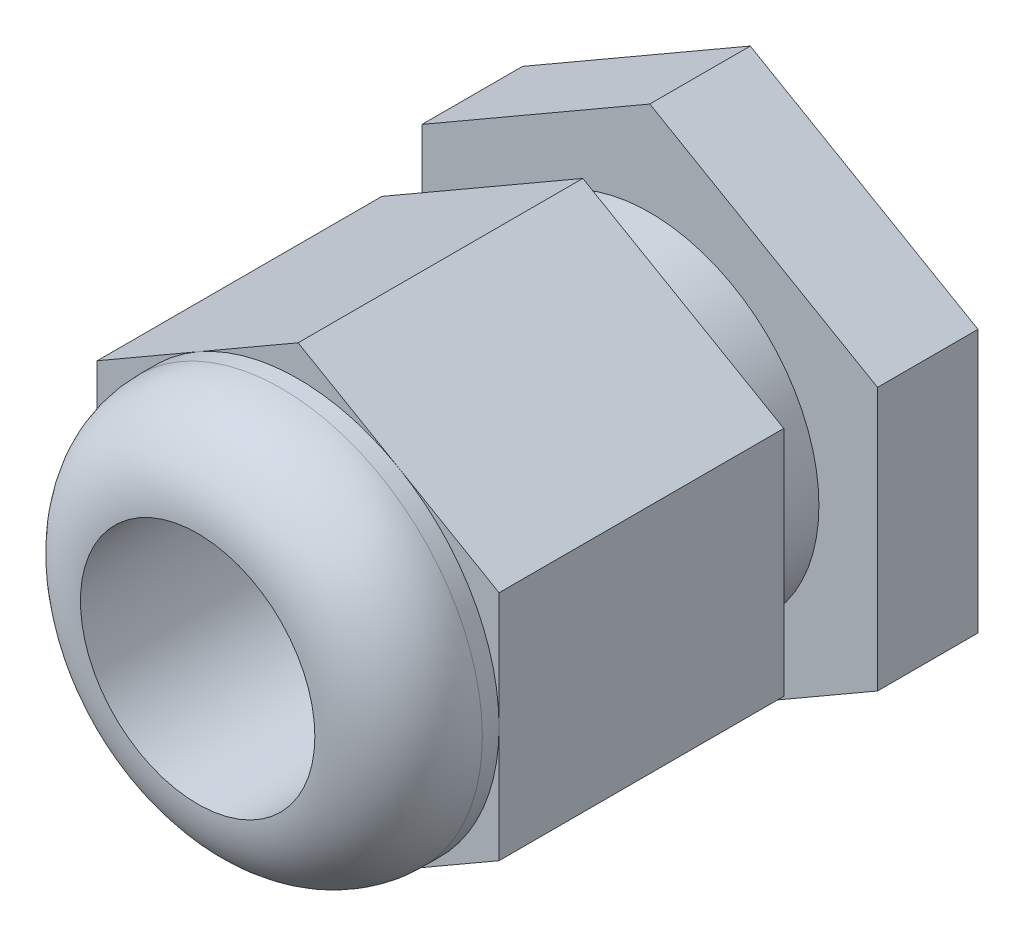
ISO-10303-21;
HEADER;
FILE_DESCRIPTION(('STEP AP214'),'2;1');
FILE_NAME('part.step','',(''),(''),'','','');
FILE_SCHEMA(('AUTOMOTIVE_DESIGN { 1 0 10303 214 1 1 1 1 }'));
ENDSEC;
DATA;
#1=APPLICATION_CONTEXT('core data for automotive mechanical design processes');
#2=APPLICATION_PROTOCOL_DEFINITION('international standard','automotive_design',2000,#1);
#3=PRODUCT_CONTEXT('',#1,'mechanical');
#4=PRODUCT('Part','Part','',(#3));
#5=PRODUCT_RELATED_PRODUCT_CATEGORY('part','',(#4));
#6=PRODUCT_DEFINITION_FORMATION('','',#4);
#7=PRODUCT_DEFINITION_CONTEXT('part definition',#1,'design');
#8=PRODUCT_DEFINITION('design','',#6,#7);
#9=PRODUCT_DEFINITION_SHAPE('','',#8);
#10=(LENGTH_UNIT() NAMED_UNIT(*) SI_UNIT(.MILLI.,.METRE.));
#11=(NAMED_UNIT(*) PLANE_ANGLE_UNIT() SI_UNIT($,.RADIAN.));
#12=(NAMED_UNIT(*) SI_UNIT($,.STERADIAN.) SOLID_ANGLE_UNIT());
#13=UNCERTAINTY_MEASURE_WITH_UNIT(LENGTH_MEASURE(1.E-05),#10,'distance_accuracy_value','');
#14=(GEOMETRIC_REPRESENTATION_CONTEXT(3) GLOBAL_UNCERTAINTY_ASSIGNED_CONTEXT((#13)) GLOBAL_UNIT_ASSIGNED_CONTEXT((#10,
#11,#12)) REPRESENTATION_CONTEXT('',''));
#15=CARTESIAN_POINT('',(0.,0.,0.));
#16=DIRECTION('',(0.,0.,1.));
#17=DIRECTION('',(1.,0.,0.));
#18=AXIS2_PLACEMENT_3D('',#15,#16,#17);
#19=CARTESIAN_POINT('',(0.,0.,-18.5));
#20=DIRECTION('',(0.,0.,-1.));
#21=DIRECTION('',(-1.,0.,0.));
#22=AXIS2_PLACEMENT_3D('',#19,#20,#21);
#23=PLANE('',#22);
#24=DIRECTION('',(0.866025403784439,0.5,0.));
#25=VECTOR('',#24,1.);
#26=CARTESIAN_POINT('',(-13.6,7.85196366097892,-18.5));
#27=LINE('',#26,#25);
#28=CARTESIAN_POINT('',(-13.6,7.85196366097892,-18.5));
#29=VERTEX_POINT('',#28);
#30=CARTESIAN_POINT('',(0.,15.7039273219578,-18.5));
#31=VERTEX_POINT('',#30);
#32=EDGE_CURVE('E185',#29,#31,#27,.T.);
#33=ORIENTED_EDGE('',*,*,#32,.T.);
#34=DIRECTION('',(0.866025403784439,-0.5,0.));
#35=VECTOR('',#34,1.);
#36=CARTESIAN_POINT('',(0.,15.7039273219578,-18.5));
#37=LINE('',#36,#35);
#38=CARTESIAN_POINT('',(13.6,7.85196366097892,-18.5));
#39=VERTEX_POINT('',#38);
#40=EDGE_CURVE('E146',#31,#39,#37,.T.);
#41=ORIENTED_EDGE('',*,*,#40,.T.);
#42=DIRECTION('',(0.,-1.,0.));
#43=VECTOR('',#42,1.);
#44=CARTESIAN_POINT('',(13.6,7.85196366097892,-18.5));
#45=LINE('',#44,#43);
#46=CARTESIAN_POINT('',(13.6,-7.85196366097891,-18.5));
#47=VERTEX_POINT('',#46);
#48=EDGE_CURVE('E189',#39,#47,#45,.T.);
#49=ORIENTED_EDGE('',*,*,#48,.T.);
#50=DIRECTION('',(-0.866025403784439,-0.5,0.));
#51=VECTOR('',#50,1.);
#52=CARTESIAN_POINT('',(13.6,-7.85196366097891,-18.5));
#53=LINE('',#52,#51);
#54=CARTESIAN_POINT('',(0.,-15.7039273219578,-18.5));
#55=VERTEX_POINT('',#54);
#56=EDGE_CURVE('E192',#47,#55,#53,.T.);
#57=ORIENTED_EDGE('',*,*,#56,.T.);
#58=DIRECTION('',(-0.866025403784439,0.5,0.));
#59=VECTOR('',#58,1.);
#60=CARTESIAN_POINT('',(0.,-15.7039273219578,-18.5));
#61=LINE('',#60,#59);
#62=CARTESIAN_POINT('',(-13.6,-7.85196366097891,-18.5));
#63=VERTEX_POINT('',#62);
#64=EDGE_CURVE('E171',#55,#63,#61,.T.);
#65=ORIENTED_EDGE('',*,*,#64,.T.);
#66=DIRECTION('',(0.,1.,0.));
#67=VECTOR('',#66,1.);
#68=CARTESIAN_POINT('',(-13.6,-7.85196366097891,-18.5));
#69=LINE('',#68,#67);
#70=EDGE_CURVE('E168',#63,#29,#69,.T.);
#71=ORIENTED_EDGE('',*,*,#70,.T.);
#72=EDGE_LOOP('',(#33,#41,#49,#57,#65,#71));
#73=FACE_BOUND('',#72,.T.);
#74=CARTESIAN_POINT('',(0.,0.,-18.5));
#75=DIRECTION('',(0.,0.,-1.));
#76=DIRECTION('',(-1.,0.,0.));
#77=AXIS2_PLACEMENT_3D('',#74,#75,#76);
#78=CIRCLE('',#77,10.1);
#79=CARTESIAN_POINT('',(-10.1,0.,-18.5));
#80=VERTEX_POINT('',#79);
#81=EDGE_CURVE('E174',#80,#80,#78,.T.);
#82=ORIENTED_EDGE('',*,*,#81,.F.);
#83=EDGE_LOOP('',(#82));
#84=FACE_BOUND('',#83,.T.);
#85=ADVANCED_FACE('F33',(#73,#84),#23,.T.);
#86=CARTESIAN_POINT('',(0.,0.,-18.5));
#87=DIRECTION('',(0.,0.,1.));
#88=DIRECTION('',(1.,0.,0.));
#89=AXIS2_PLACEMENT_3D('',#86,#87,#88);
#90=CYLINDRICAL_SURFACE('',#89,10.1);
#91=CARTESIAN_POINT('',(0.,0.,-8.5));
#92=DIRECTION('',(0.,0.,1.));
#93=DIRECTION('',(1.,0.,0.));
#94=AXIS2_PLACEMENT_3D('',#91,#92,#93);
#95=CIRCLE('',#94,10.1);
#96=CARTESIAN_POINT('',(10.1,0.,-8.5));
#97=VERTEX_POINT('',#96);
#98=EDGE_CURVE('E41',#97,#97,#95,.F.);
#99=ORIENTED_EDGE('',*,*,#98,.T.);
#100=EDGE_LOOP('',(#99));
#101=FACE_BOUND('',#100,.T.);
#102=CARTESIAN_POINT('',(0.,0.,-12.5));
#103=DIRECTION('',(0.,0.,-1.));
#104=DIRECTION('',(-1.,0.,0.));
#105=AXIS2_PLACEMENT_3D('',#102,#103,#104);
#106=CIRCLE('',#105,10.1);
#107=CARTESIAN_POINT('',(-10.1,0.,-12.5));
#108=VERTEX_POINT('',#107);
#109=EDGE_CURVE('E11',#108,#108,#106,.T.);
#110=ORIENTED_EDGE('',*,*,#109,.F.);
#111=EDGE_LOOP('',(#110));
#112=FACE_BOUND('',#111,.T.);
#113=ADVANCED_FACE('F267',(#101,#112),#90,.T.);
#114=CARTESIAN_POINT('',(0.,0.,-8.5));
#115=DIRECTION('',(0.,0.,1.));
#116=DIRECTION('',(1.,0.,0.));
#117=AXIS2_PLACEMENT_3D('',#114,#115,#116);
#118=PLANE('',#117);
#119=DIRECTION('',(-0.866025403784439,0.5,0.));
#120=VECTOR('',#119,1.);
#121=CARTESIAN_POINT('',(12.,6.92820323027552,-8.5));
#122=LINE('',#121,#120);
#123=CARTESIAN_POINT('',(12.,6.92820323027552,-8.5));
#124=VERTEX_POINT('',#123);
#125=CARTESIAN_POINT('',(0.,13.856406460551,-8.5));
#126=VERTEX_POINT('',#125);
#127=EDGE_CURVE('E208',#124,#126,#122,.T.);
#128=ORIENTED_EDGE('',*,*,#127,.F.);
#129=DIRECTION('',(0.,1.,0.));
#130=VECTOR('',#129,1.);
#131=CARTESIAN_POINT('',(12.,-6.92820323027551,-8.5));
#132=LINE('',#131,#130);
#133=CARTESIAN_POINT('',(12.,-6.92820323027551,-8.5));
#134=VERTEX_POINT('',#133);
#135=EDGE_CURVE('E243',#134,#124,#132,.T.);
#136=ORIENTED_EDGE('',*,*,#135,.F.);
#137=DIRECTION('',(0.866025403784439,0.5,0.));
#138=VECTOR('',#137,1.);
#139=CARTESIAN_POINT('',(0.,-13.856406460551,-8.5));
#140=LINE('',#139,#138);
#141=CARTESIAN_POINT('',(0.,-13.856406460551,-8.5));
#142=VERTEX_POINT('',#141);
#143=EDGE_CURVE('E241',#142,#134,#140,.T.);
#144=ORIENTED_EDGE('',*,*,#143,.F.);
#145=DIRECTION('',(0.866025403784438,-0.5,0.));
#146=VECTOR('',#145,1.);
#147=CARTESIAN_POINT('',(-12.,-6.92820323027551,-8.5));
#148=LINE('',#147,#146);
#149=CARTESIAN_POINT('',(-12.,-6.92820323027551,-8.5));
#150=VERTEX_POINT('',#149);
#151=EDGE_CURVE('E239',#150,#142,#148,.T.);
#152=ORIENTED_EDGE('',*,*,#151,.F.);
#153=DIRECTION('',(0.,-1.,0.));
#154=VECTOR('',#153,1.);
#155=CARTESIAN_POINT('',(-12.,6.92820323027551,-8.5));
#156=LINE('',#155,#154);
#157=CARTESIAN_POINT('',(-12.,6.92820323027551,-8.5));
#158=VERTEX_POINT('',#157);
#159=EDGE_CURVE('E237',#158,#150,#156,.T.);
#160=ORIENTED_EDGE('',*,*,#159,.F.);
#161=DIRECTION('',(-0.866025403784439,-0.5,0.));
#162=VECTOR('',#161,1.);
#163=CARTESIAN_POINT('',(0.,13.856406460551,-8.5));
#164=LINE('',#163,#162);
#165=EDGE_CURVE('E235',#126,#158,#164,.T.);
#166=ORIENTED_EDGE('',*,*,#165,.F.);
#167=EDGE_LOOP('',(#128,#136,#144,#152,#160,#166));
#168=FACE_BOUND('',#167,.T.);
#169=ORIENTED_EDGE('',*,*,#98,.F.);
#170=EDGE_LOOP('',(#169));
#171=FACE_BOUND('',#170,.T.);
#172=ADVANCED_FACE('F270',(#168,#171),#118,.F.);
#173=CARTESIAN_POINT('',(0.,0.,8.5));
#174=DIRECTION('',(0.,0.,1.));
#175=DIRECTION('',(1.,0.,0.));
#176=AXIS2_PLACEMENT_3D('',#173,#174,#175);
#177=PLANE('',#176);
#178=CARTESIAN_POINT('',(0.,0.,8.5));
#179=DIRECTION('',(0.,0.,1.));
#180=DIRECTION('',(1.,0.,0.));
#181=AXIS2_PLACEMENT_3D('',#178,#179,#180);
#182=CIRCLE('',#181,12.);
#183=CARTESIAN_POINT('',(12.,0.,8.5));
#184=VERTEX_POINT('',#183);
#185=CARTESIAN_POINT('',(6.,10.3923048454133,8.5));
#186=VERTEX_POINT('',#185);
#187=EDGE_CURVE('E198',#184,#186,#182,.T.);
#188=ORIENTED_EDGE('',*,*,#187,.F.);
#189=DIRECTION('',(0.,1.,0.));
#190=VECTOR('',#189,1.);
#191=CARTESIAN_POINT('',(12.,-6.92820323027551,8.5));
#192=LINE('',#191,#190);
#193=CARTESIAN_POINT('',(12.,6.92820323027552,8.5));
#194=VERTEX_POINT('',#193);
#195=EDGE_CURVE('E229',#184,#194,#192,.T.);
#196=ORIENTED_EDGE('',*,*,#195,.T.);
#197=DIRECTION('',(-0.866025403784439,0.5,0.));
#198=VECTOR('',#197,1.);
#199=CARTESIAN_POINT('',(12.,6.92820323027552,8.5));
#200=LINE('',#199,#198);
#201=EDGE_CURVE('E210',#194,#186,#200,.T.);
#202=ORIENTED_EDGE('',*,*,#201,.T.);
#203=EDGE_LOOP('',(#188,#196,#202));
#204=FACE_BOUND('',#203,.T.);
#205=ADVANCED_FACE('F272',(#204),#177,.T.);
#206=CARTESIAN_POINT('',(-6.,10.3923048454133,8.5));
#207=VERTEX_POINT('',#206);
#208=EDGE_CURVE('E209',#186,#207,#182,.T.);
#209=ORIENTED_EDGE('',*,*,#208,.F.);
#210=CARTESIAN_POINT('',(0.,13.856406460551,8.5));
#211=VERTEX_POINT('',#210);
#212=EDGE_CURVE('E214',#186,#211,#200,.T.);
#213=ORIENTED_EDGE('',*,*,#212,.T.);
#214=DIRECTION('',(-0.866025403784439,-0.5,0.));
#215=VECTOR('',#214,1.);
#216=CARTESIAN_POINT('',(0.,13.856406460551,8.5));
#217=LINE('',#216,#215);
#218=EDGE_CURVE('E215',#211,#207,#217,.T.);
#219=ORIENTED_EDGE('',*,*,#218,.T.);
#220=EDGE_LOOP('',(#209,#213,#219));
#221=FACE_BOUND('',#220,.T.);
#222=ADVANCED_FACE('F279',(#221),#177,.T.);
#223=CARTESIAN_POINT('',(-12.,0.,8.5));
#224=VERTEX_POINT('',#223);
#225=EDGE_CURVE('E328',#207,#224,#182,.T.);
#226=ORIENTED_EDGE('',*,*,#225,.F.);
#227=CARTESIAN_POINT('',(-12.,6.92820323027551,8.5));
#228=VERTEX_POINT('',#227);
#229=EDGE_CURVE('E213',#207,#228,#217,.T.);
#230=ORIENTED_EDGE('',*,*,#229,.T.);
#231=DIRECTION('',(0.,-1.,0.));
#232=VECTOR('',#231,1.);
#233=CARTESIAN_POINT('',(-12.,6.92820323027551,8.5));
#234=LINE('',#233,#232);
#235=EDGE_CURVE('E219',#228,#224,#234,.T.);
#236=ORIENTED_EDGE('',*,*,#235,.T.);
#237=EDGE_LOOP('',(#226,#230,#236));
#238=FACE_BOUND('',#237,.T.);
#239=ADVANCED_FACE('F315',(#238),#177,.T.);
#240=CARTESIAN_POINT('',(-6.00000000000001,-10.3923048454133,8.5));
#241=VERTEX_POINT('',#240);
#242=EDGE_CURVE('E322',#224,#241,#182,.T.);
#243=ORIENTED_EDGE('',*,*,#242,.F.);
#244=CARTESIAN_POINT('',(-12.,-6.92820323027551,8.5));
#245=VERTEX_POINT('',#244);
#246=EDGE_CURVE('E218',#224,#245,#234,.T.);
#247=ORIENTED_EDGE('',*,*,#246,.T.);
#248=DIRECTION('',(0.866025403784438,-0.5,0.));
#249=VECTOR('',#248,1.);
#250=CARTESIAN_POINT('',(-12.,-6.92820323027551,8.5));
#251=LINE('',#250,#249);
#252=EDGE_CURVE('E223',#245,#241,#251,.T.);
#253=ORIENTED_EDGE('',*,*,#252,.T.);
#254=EDGE_LOOP('',(#243,#247,#253));
#255=FACE_BOUND('',#254,.T.);
#256=ADVANCED_FACE('F308',(#255),#177,.T.);
#257=CARTESIAN_POINT('',(6.,-10.3923048454133,8.5));
#258=VERTEX_POINT('',#257);
#259=EDGE_CURVE('E56',#241,#258,#182,.T.);
#260=ORIENTED_EDGE('',*,*,#259,.F.);
#261=CARTESIAN_POINT('',(0.,-13.856406460551,8.5));
#262=VERTEX_POINT('',#261);
#263=EDGE_CURVE('E222',#241,#262,#251,.T.);
#264=ORIENTED_EDGE('',*,*,#263,.T.);
#265=DIRECTION('',(0.866025403784439,0.5,0.));
#266=VECTOR('',#265,1.);
#267=CARTESIAN_POINT('',(0.,-13.856406460551,8.5));
#268=LINE('',#267,#266);
#269=EDGE_CURVE('E227',#262,#258,#268,.T.);
#270=ORIENTED_EDGE('',*,*,#269,.T.);
#271=EDGE_LOOP('',(#260,#264,#270));
#272=FACE_BOUND('',#271,.T.);
#273=ADVANCED_FACE('F300',(#272),#177,.T.);
#274=CARTESIAN_POINT('',(12.,6.92820323027552,8.5));
#275=DIRECTION('',(-0.5,-0.866025403784439,0.));
#276=DIRECTION('',(0.866025403784439,-0.5,0.));
#277=AXIS2_PLACEMENT_3D('',#274,#275,#276);
#278=PLANE('',#277);
#279=ORIENTED_EDGE('',*,*,#127,.T.);
#280=DIRECTION('',(0.,0.,-1.));
#281=VECTOR('',#280,1.);
#282=CARTESIAN_POINT('',(0.,13.856406460551,8.5));
#283=LINE('',#282,#281);
#284=EDGE_CURVE('E259',#211,#126,#283,.T.);
#285=ORIENTED_EDGE('',*,*,#284,.F.);
#286=ORIENTED_EDGE('',*,*,#212,.F.);
#287=ORIENTED_EDGE('',*,*,#201,.F.);
#288=DIRECTION('',(0.,0.,-1.));
#289=VECTOR('',#288,1.);
#290=CARTESIAN_POINT('',(12.,6.92820323027552,8.5));
#291=LINE('',#290,#289);
#292=EDGE_CURVE('E232',#194,#124,#291,.T.);
#293=ORIENTED_EDGE('',*,*,#292,.T.);
#294=EDGE_LOOP('',(#279,#285,#286,#287,#293));
#295=FACE_BOUND('',#294,.T.);
#296=ADVANCED_FACE('F307',(#295),#278,.F.);
#297=CARTESIAN_POINT('',(0.,13.856406460551,8.5));
#298=DIRECTION('',(0.5,-0.866025403784439,0.));
#299=DIRECTION('',(0.866025403784439,0.5,0.));
#300=AXIS2_PLACEMENT_3D('',#297,#298,#299);
#301=PLANE('',#300);
#302=ORIENTED_EDGE('',*,*,#165,.T.);
#303=DIRECTION('',(0.,0.,-1.));
#304=VECTOR('',#303,1.);
#305=CARTESIAN_POINT('',(-12.,6.92820323027551,8.5));
#306=LINE('',#305,#304);
#307=EDGE_CURVE('E256',#228,#158,#306,.T.);
#308=ORIENTED_EDGE('',*,*,#307,.F.);
#309=ORIENTED_EDGE('',*,*,#229,.F.);
#310=ORIENTED_EDGE('',*,*,#218,.F.);
#311=ORIENTED_EDGE('',*,*,#284,.T.);
#312=EDGE_LOOP('',(#302,#308,#309,#310,#311));
#313=FACE_BOUND('',#312,.T.);
#314=ADVANCED_FACE('F313',(#313),#301,.F.);
#315=CARTESIAN_POINT('',(-12.,6.92820323027551,8.5));
#316=DIRECTION('',(1.,0.,0.));
#317=DIRECTION('',(0.,1.,0.));
#318=AXIS2_PLACEMENT_3D('',#315,#316,#317);
#319=PLANE('',#318);
#320=ORIENTED_EDGE('',*,*,#159,.T.);
#321=DIRECTION('',(0.,0.,-1.));
#322=VECTOR('',#321,1.);
#323=CARTESIAN_POINT('',(-12.,-6.92820323027551,8.5));
#324=LINE('',#323,#322);
#325=EDGE_CURVE('E253',#245,#150,#324,.T.);
#326=ORIENTED_EDGE('',*,*,#325,.F.);
#327=ORIENTED_EDGE('',*,*,#246,.F.);
#328=ORIENTED_EDGE('',*,*,#235,.F.);
#329=ORIENTED_EDGE('',*,*,#307,.T.);
#330=EDGE_LOOP('',(#320,#326,#327,#328,#329));
#331=FACE_BOUND('',#330,.T.);
#332=ADVANCED_FACE('F331',(#331),#319,.F.);
#333=CARTESIAN_POINT('',(-12.,-6.92820323027551,8.5));
#334=DIRECTION('',(0.5,0.866025403784438,0.));
#335=DIRECTION('',(-0.866025403784438,0.5,0.));
#336=AXIS2_PLACEMENT_3D('',#333,#334,#335);
#337=PLANE('',#336);
#338=ORIENTED_EDGE('',*,*,#151,.T.);
#339=DIRECTION('',(0.,0.,-1.));
#340=VECTOR('',#339,1.);
#341=CARTESIAN_POINT('',(0.,-13.856406460551,8.5));
#342=LINE('',#341,#340);
#343=EDGE_CURVE('E250',#262,#142,#342,.T.);
#344=ORIENTED_EDGE('',*,*,#343,.F.);
#345=ORIENTED_EDGE('',*,*,#263,.F.);
#346=ORIENTED_EDGE('',*,*,#252,.F.);
#347=ORIENTED_EDGE('',*,*,#325,.T.);
#348=EDGE_LOOP('',(#338,#344,#345,#346,#347));
#349=FACE_BOUND('',#348,.T.);
#350=ADVANCED_FACE('F350',(#349),#337,.F.);
#351=CARTESIAN_POINT('',(0.,-13.856406460551,8.5));
#352=DIRECTION('',(-0.5,0.866025403784439,0.));
#353=DIRECTION('',(-0.866025403784439,-0.5,0.));
#354=AXIS2_PLACEMENT_3D('',#351,#352,#353);
#355=PLANE('',#354);
#356=ORIENTED_EDGE('',*,*,#143,.T.);
#357=DIRECTION('',(0.,0.,-1.));
#358=VECTOR('',#357,1.);
#359=CARTESIAN_POINT('',(12.,-6.92820323027551,8.5));
#360=LINE('',#359,#358);
#361=CARTESIAN_POINT('',(12.,-6.92820323027551,8.5));
#362=VERTEX_POINT('',#361);
#363=EDGE_CURVE('E247',#362,#134,#360,.T.);
#364=ORIENTED_EDGE('',*,*,#363,.F.);
#365=EDGE_CURVE('E226',#258,#362,#268,.T.);
#366=ORIENTED_EDGE('',*,*,#365,.F.);
#367=ORIENTED_EDGE('',*,*,#269,.F.);
#368=ORIENTED_EDGE('',*,*,#343,.T.);
#369=EDGE_LOOP('',(#356,#364,#366,#367,#368));
#370=FACE_BOUND('',#369,.T.);
#371=ADVANCED_FACE('F304',(#370),#355,.F.);
#372=CARTESIAN_POINT('',(12.,-6.92820323027551,8.5));
#373=DIRECTION('',(-1.,0.,0.));
#374=DIRECTION('',(0.,0.,1.));
#375=AXIS2_PLACEMENT_3D('',#372,#373,#374);
#376=PLANE('',#375);
#377=ORIENTED_EDGE('',*,*,#135,.T.);
#378=ORIENTED_EDGE('',*,*,#292,.F.);
#379=ORIENTED_EDGE('',*,*,#195,.F.);
#380=EDGE_CURVE('E230',#362,#184,#192,.T.);
#381=ORIENTED_EDGE('',*,*,#380,.F.);
#382=ORIENTED_EDGE('',*,*,#363,.T.);
#383=EDGE_LOOP('',(#377,#378,#379,#381,#382));
#384=FACE_BOUND('',#383,.T.);
#385=ADVANCED_FACE('F299',(#384),#376,.F.);
#386=EDGE_CURVE('E48',#258,#184,#182,.T.);
#387=ORIENTED_EDGE('',*,*,#386,.F.);
#388=ORIENTED_EDGE('',*,*,#365,.T.);
#389=ORIENTED_EDGE('',*,*,#380,.T.);
#390=EDGE_LOOP('',(#387,#388,#389));
#391=FACE_BOUND('',#390,.T.);
#392=ADVANCED_FACE('F282',(#391),#177,.T.);
#393=CARTESIAN_POINT('',(0.,0.,14.5));
#394=DIRECTION('',(0.,0.,-1.));
#395=DIRECTION('',(-1.,0.,0.));
#396=AXIS2_PLACEMENT_3D('',#393,#394,#395);
#397=CYLINDRICAL_SURFACE('',#396,12.);
#398=CARTESIAN_POINT('',(0.,0.,9.5));
#399=DIRECTION('',(0.,0.,1.));
#400=DIRECTION('',(1.,0.,0.));
#401=AXIS2_PLACEMENT_3D('',#398,#399,#400);
#402=CIRCLE('',#401,12.);
#403=CARTESIAN_POINT('',(12.,0.,9.5));
#404=VERTEX_POINT('',#403);
#405=EDGE_CURVE('E262',#404,#404,#402,.F.);
#406=ORIENTED_EDGE('',*,*,#405,.T.);
#407=EDGE_LOOP('',(#406));
#408=FACE_BOUND('',#407,.T.);
#409=ORIENTED_EDGE('',*,*,#187,.T.);
#410=ORIENTED_EDGE('',*,*,#208,.T.);
#411=ORIENTED_EDGE('',*,*,#225,.T.);
#412=ORIENTED_EDGE('',*,*,#242,.T.);
#413=ORIENTED_EDGE('',*,*,#259,.T.);
#414=ORIENTED_EDGE('',*,*,#386,.T.);
#415=EDGE_LOOP('',(#409,#410,#411,#412,#413,#414));
#416=FACE_BOUND('',#415,.T.);
#417=ADVANCED_FACE('F295',(#408,#416),#397,.T.);
#418=CARTESIAN_POINT('',(0.,0.,9.5));
#419=DIRECTION('',(0.,0.,1.));
#420=DIRECTION('',(1.,0.,0.));
#421=AXIS2_PLACEMENT_3D('',#418,#419,#420);
#422=TOROIDAL_SURFACE('',#421,7.00000000000001,5.);
#423=ORIENTED_EDGE('',*,*,#405,.F.);
#424=EDGE_LOOP('',(#423));
#425=FACE_BOUND('',#424,.T.);
#426=CARTESIAN_POINT('',(0.,0.,14.5));
#427=DIRECTION('',(0.,0.,1.));
#428=DIRECTION('',(1.,0.,0.));
#429=AXIS2_PLACEMENT_3D('',#426,#427,#428);
#430=CIRCLE('',#429,7.00000000000001);
#431=CARTESIAN_POINT('',(7.00000000000001,0.,14.5));
#432=VERTEX_POINT('',#431);
#433=EDGE_CURVE('E524',#432,#432,#430,.T.);
#434=ORIENTED_EDGE('',*,*,#433,.F.);
#435=EDGE_LOOP('',(#434));
#436=FACE_BOUND('',#435,.T.);
#437=ADVANCED_FACE('F35',(#425,#436),#422,.T.);
#438=CARTESIAN_POINT('',(0.,0.,-12.5));
#439=DIRECTION('',(0.,0.,-1.));
#440=DIRECTION('',(-1.,0.,0.));
#441=AXIS2_PLACEMENT_3D('',#438,#439,#440);
#442=PLANE('',#441);
#443=DIRECTION('',(0.866025403784439,0.5,0.));
#444=VECTOR('',#443,1.);
#445=CARTESIAN_POINT('',(-13.6,7.85196366097892,-12.5));
#446=LINE('',#445,#444);
#447=CARTESIAN_POINT('',(-13.6,7.85196366097892,-12.5));
#448=VERTEX_POINT('',#447);
#449=CARTESIAN_POINT('',(0.,15.7039273219578,-12.5));
#450=VERTEX_POINT('',#449);
#451=EDGE_CURVE('E160',#448,#450,#446,.T.);
#452=ORIENTED_EDGE('',*,*,#451,.F.);
#453=DIRECTION('',(0.,1.,0.));
#454=VECTOR('',#453,1.);
#455=CARTESIAN_POINT('',(-13.6,-7.85196366097891,-12.5));
#456=LINE('',#455,#454);
#457=CARTESIAN_POINT('',(-13.6,-7.85196366097891,-12.5));
#458=VERTEX_POINT('',#457);
#459=EDGE_CURVE('E152',#458,#448,#456,.T.);
#460=ORIENTED_EDGE('',*,*,#459,.F.);
#461=DIRECTION('',(-0.866025403784439,0.5,0.));
#462=VECTOR('',#461,1.);
#463=CARTESIAN_POINT('',(0.,-15.7039273219578,-12.5));
#464=LINE('',#463,#462);
#465=CARTESIAN_POINT('',(0.,-15.7039273219578,-12.5));
#466=VERTEX_POINT('',#465);
#467=EDGE_CURVE('E181',#466,#458,#464,.T.);
#468=ORIENTED_EDGE('',*,*,#467,.F.);
#469=DIRECTION('',(-0.866025403784439,-0.5,0.));
#470=VECTOR('',#469,1.);
#471=CARTESIAN_POINT('',(13.6,-7.85196366097891,-12.5));
#472=LINE('',#471,#470);
#473=CARTESIAN_POINT('',(13.6,-7.85196366097891,-12.5));
#474=VERTEX_POINT('',#473);
#475=EDGE_CURVE('E178',#474,#466,#472,.T.);
#476=ORIENTED_EDGE('',*,*,#475,.F.);
#477=DIRECTION('',(0.,-1.,0.));
#478=VECTOR('',#477,1.);
#479=CARTESIAN_POINT('',(13.6,7.85196366097892,-12.5));
#480=LINE('',#479,#478);
#481=CARTESIAN_POINT('',(13.6,7.85196366097892,-12.5));
#482=VERTEX_POINT('',#481);
#483=EDGE_CURVE('E164',#482,#474,#480,.T.);
#484=ORIENTED_EDGE('',*,*,#483,.F.);
#485=DIRECTION('',(0.866025403784439,-0.5,0.));
#486=VECTOR('',#485,1.);
#487=CARTESIAN_POINT('',(0.,15.7039273219578,-12.5));
#488=LINE('',#487,#486);
#489=EDGE_CURVE('E144',#450,#482,#488,.T.);
#490=ORIENTED_EDGE('',*,*,#489,.F.);
#491=EDGE_LOOP('',(#452,#460,#468,#476,#484,#490));
#492=FACE_BOUND('',#491,.T.);
#493=ORIENTED_EDGE('',*,*,#109,.T.);
#494=EDGE_LOOP('',(#493));
#495=FACE_BOUND('',#494,.T.);
#496=ADVANCED_FACE('F157',(#492,#495),#442,.F.);
#497=CARTESIAN_POINT('',(-13.6,7.85196366097892,-12.5));
#498=DIRECTION('',(-0.5,0.866025403784439,0.));
#499=DIRECTION('',(-0.866025403784439,-0.5,0.));
#500=AXIS2_PLACEMENT_3D('',#497,#498,#499);
#501=PLANE('',#500);
#502=ORIENTED_EDGE('',*,*,#32,.F.);
#503=DIRECTION('',(0.,0.,-1.));
#504=VECTOR('',#503,1.);
#505=CARTESIAN_POINT('',(-13.6,7.85196366097892,-12.5));
#506=LINE('',#505,#504);
#507=EDGE_CURVE('E167',#448,#29,#506,.T.);
#508=ORIENTED_EDGE('',*,*,#507,.F.);
#509=ORIENTED_EDGE('',*,*,#451,.T.);
#510=DIRECTION('',(0.,0.,-1.));
#511=VECTOR('',#510,1.);
#512=CARTESIAN_POINT('',(0.,15.7039273219578,-12.5));
#513=LINE('',#512,#511);
#514=EDGE_CURVE('E141',#450,#31,#513,.T.);
#515=ORIENTED_EDGE('',*,*,#514,.T.);
#516=EDGE_LOOP('',(#502,#508,#509,#515));
#517=FACE_BOUND('',#516,.T.);
#518=ADVANCED_FACE('F166',(#517),#501,.T.);
#519=CARTESIAN_POINT('',(-13.6,-7.85196366097891,-12.5));
#520=DIRECTION('',(-1.,0.,0.));
#521=DIRECTION('',(0.,0.,1.));
#522=AXIS2_PLACEMENT_3D('',#519,#520,#521);
#523=PLANE('',#522);
#524=ORIENTED_EDGE('',*,*,#70,.F.);
#525=DIRECTION('',(0.,0.,-1.));
#526=VECTOR('',#525,1.);
#527=CARTESIAN_POINT('',(-13.6,-7.85196366097891,-12.5));
#528=LINE('',#527,#526);
#529=EDGE_CURVE('E199',#458,#63,#528,.T.);
#530=ORIENTED_EDGE('',*,*,#529,.F.);
#531=ORIENTED_EDGE('',*,*,#459,.T.);
#532=ORIENTED_EDGE('',*,*,#507,.T.);
#533=EDGE_LOOP('',(#524,#530,#531,#532));
#534=FACE_BOUND('',#533,.T.);
#535=ADVANCED_FACE('F434',(#534),#523,.T.);
#536=CARTESIAN_POINT('',(0.,-15.7039273219578,-12.5));
#537=DIRECTION('',(-0.5,-0.866025403784438,0.));
#538=DIRECTION('',(0.866025403784439,-0.5,0.));
#539=AXIS2_PLACEMENT_3D('',#536,#537,#538);
#540=PLANE('',#539);
#541=ORIENTED_EDGE('',*,*,#64,.F.);
#542=DIRECTION('',(0.,0.,-1.));
#543=VECTOR('',#542,1.);
#544=CARTESIAN_POINT('',(0.,-15.7039273219578,-12.5));
#545=LINE('',#544,#543);
#546=EDGE_CURVE('E201',#466,#55,#545,.T.);
#547=ORIENTED_EDGE('',*,*,#546,.F.);
#548=ORIENTED_EDGE('',*,*,#467,.T.);
#549=ORIENTED_EDGE('',*,*,#529,.T.);
#550=EDGE_LOOP('',(#541,#547,#548,#549));
#551=FACE_BOUND('',#550,.T.);
#552=ADVANCED_FACE('F442',(#551),#540,.T.);
#553=CARTESIAN_POINT('',(13.6,-7.85196366097891,-12.5));
#554=DIRECTION('',(0.5,-0.866025403784438,0.));
#555=DIRECTION('',(0.866025403784439,0.5,0.));
#556=AXIS2_PLACEMENT_3D('',#553,#554,#555);
#557=PLANE('',#556);
#558=ORIENTED_EDGE('',*,*,#56,.F.);
#559=DIRECTION('',(0.,0.,-1.));
#560=VECTOR('',#559,1.);
#561=CARTESIAN_POINT('',(13.6,-7.85196366097891,-12.5));
#562=LINE('',#561,#560);
#563=EDGE_CURVE('E203',#474,#47,#562,.T.);
#564=ORIENTED_EDGE('',*,*,#563,.F.);
#565=ORIENTED_EDGE('',*,*,#475,.T.);
#566=ORIENTED_EDGE('',*,*,#546,.T.);
#567=EDGE_LOOP('',(#558,#564,#565,#566));
#568=FACE_BOUND('',#567,.T.);
#569=ADVANCED_FACE('F452',(#568),#557,.T.);
#570=CARTESIAN_POINT('',(13.6,7.85196366097892,-12.5));
#571=DIRECTION('',(1.,0.,0.));
#572=DIRECTION('',(0.,1.,0.));
#573=AXIS2_PLACEMENT_3D('',#570,#571,#572);
#574=PLANE('',#573);
#575=ORIENTED_EDGE('',*,*,#48,.F.);
#576=DIRECTION('',(0.,0.,-1.));
#577=VECTOR('',#576,1.);
#578=CARTESIAN_POINT('',(13.6,7.85196366097892,-12.5));
#579=LINE('',#578,#577);
#580=EDGE_CURVE('E151',#482,#39,#579,.T.);
#581=ORIENTED_EDGE('',*,*,#580,.F.);
#582=ORIENTED_EDGE('',*,*,#483,.T.);
#583=ORIENTED_EDGE('',*,*,#563,.T.);
#584=EDGE_LOOP('',(#575,#581,#582,#583));
#585=FACE_BOUND('',#584,.T.);
#586=ADVANCED_FACE('F462',(#585),#574,.T.);
#587=CARTESIAN_POINT('',(0.,15.7039273219578,-12.5));
#588=DIRECTION('',(0.5,0.866025403784439,0.));
#589=DIRECTION('',(-0.866025403784439,0.5,0.));
#590=AXIS2_PLACEMENT_3D('',#587,#588,#589);
#591=PLANE('',#590);
#592=ORIENTED_EDGE('',*,*,#40,.F.);
#593=ORIENTED_EDGE('',*,*,#514,.F.);
#594=ORIENTED_EDGE('',*,*,#489,.T.);
#595=ORIENTED_EDGE('',*,*,#580,.T.);
#596=EDGE_LOOP('',(#592,#593,#594,#595));
#597=FACE_BOUND('',#596,.T.);
#598=ADVANCED_FACE('F143',(#597),#591,.T.);
#599=CARTESIAN_POINT('',(0.,0.,-19.5));
#600=DIRECTION('',(0.,0.,1.));
#601=DIRECTION('',(1.,0.,0.));
#602=AXIS2_PLACEMENT_3D('',#599,#600,#601);
#603=CYLINDRICAL_SURFACE('',#602,10.1);
#604=CARTESIAN_POINT('',(0.,0.,-19.5));
#605=DIRECTION('',(0.,0.,-1.));
#606=DIRECTION('',(-1.,0.,0.));
#607=AXIS2_PLACEMENT_3D('',#604,#605,#606);
#608=CIRCLE('',#607,10.1);
#609=CARTESIAN_POINT('',(-10.1,0.,-19.5));
#610=VERTEX_POINT('',#609);
#611=EDGE_CURVE('E187',#610,#610,#608,.T.);
#612=ORIENTED_EDGE('',*,*,#611,.F.);
#613=EDGE_LOOP('',(#612));
#614=FACE_BOUND('',#613,.T.);
#615=ORIENTED_EDGE('',*,*,#81,.T.);
#616=EDGE_LOOP('',(#615));
#617=FACE_BOUND('',#616,.T.);
#618=ADVANCED_FACE('F480',(#614,#617),#603,.T.);
#619=CARTESIAN_POINT('',(0.,0.,-19.5));
#620=DIRECTION('',(0.,0.,-1.));
#621=DIRECTION('',(-1.,0.,0.));
#622=AXIS2_PLACEMENT_3D('',#619,#620,#621);
#623=PLANE('',#622);
#624=CARTESIAN_POINT('',(0.,0.,-19.5));
#625=DIRECTION('',(0.,0.,-1.));
#626=DIRECTION('',(-1.,0.,0.));
#627=AXIS2_PLACEMENT_3D('',#624,#625,#626);
#628=CIRCLE('',#627,7.00000000000001);
#629=CARTESIAN_POINT('',(-7.00000000000001,0.,-19.5));
#630=VERTEX_POINT('',#629);
#631=EDGE_CURVE('E521',#630,#630,#628,.F.);
#632=ORIENTED_EDGE('',*,*,#631,.T.);
#633=EDGE_LOOP('',(#632));
#634=FACE_BOUND('',#633,.T.);
#635=ORIENTED_EDGE('',*,*,#611,.T.);
#636=EDGE_LOOP('',(#635));
#637=FACE_BOUND('',#636,.T.);
#638=ADVANCED_FACE('F494',(#634,#637),#623,.T.);
#639=CARTESIAN_POINT('',(0.,0.,-19.501));
#640=DIRECTION('',(0.,0.,1.));
#641=DIRECTION('',(1.,0.,0.));
#642=AXIS2_PLACEMENT_3D('',#639,#640,#641);
#643=CYLINDRICAL_SURFACE('',#642,7.00000000000001);
#644=ORIENTED_EDGE('',*,*,#631,.F.);
#645=EDGE_LOOP('',(#644));
#646=FACE_BOUND('',#645,.T.);
#647=ORIENTED_EDGE('',*,*,#433,.T.);
#648=EDGE_LOOP('',(#647));
#649=FACE_BOUND('',#648,.T.);
#650=ADVANCED_FACE('F504',(#646,#649),#643,.F.);
#651=CLOSED_SHELL('',(#85,#113,#172,#205,#222,#239,#256,#273,#296,#314,#332,#350,#371,#385,#392,
#417,#437,#496,#518,#535,#552,#569,#586,#598,#618,#638,#650));
#652=MANIFOLD_SOLID_BREP('B2',#651);
#653=ADVANCED_BREP_SHAPE_REPRESENTATION('',(#18,#652),#14);
#654=SHAPE_DEFINITION_REPRESENTATION(#9,#653);
ENDSEC;
END-ISO-10303-21;
